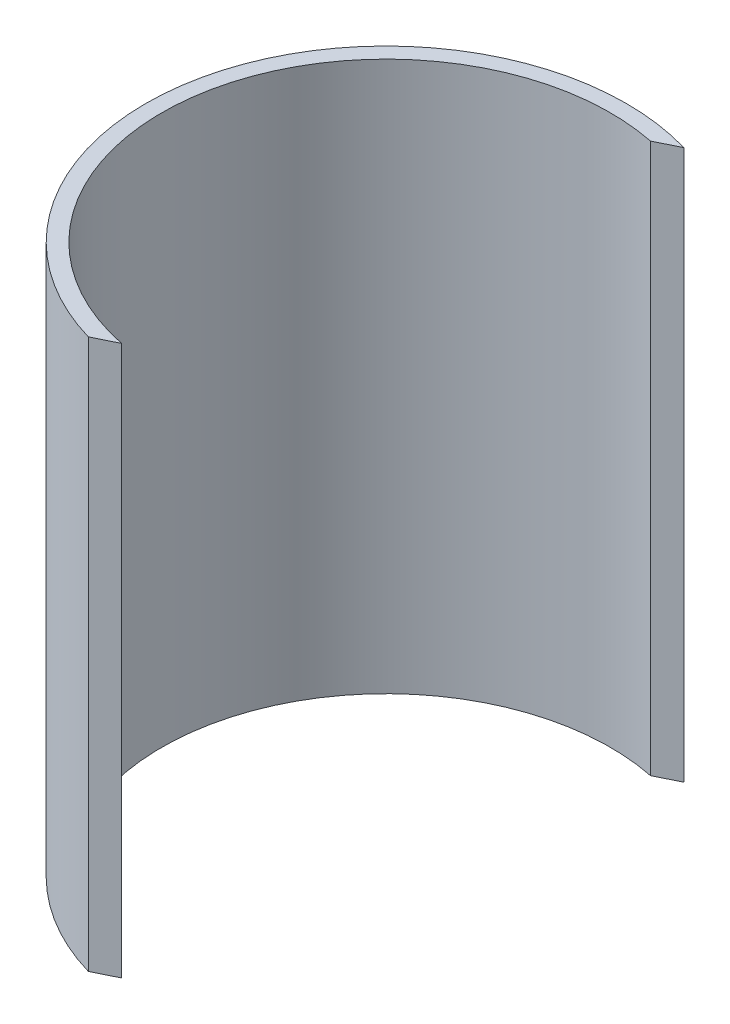
ISO-10303-21;
HEADER;
FILE_DESCRIPTION(('STEP AP214'),'2;1');
FILE_NAME('part.step','',(''),(''),'','','');
FILE_SCHEMA(('AUTOMOTIVE_DESIGN { 1 0 10303 214 1 1 1 1 }'));
ENDSEC;
DATA;
#1=APPLICATION_CONTEXT('core data for automotive mechanical design processes');
#2=APPLICATION_PROTOCOL_DEFINITION('international standard','automotive_design',2000,#1);
#3=PRODUCT_CONTEXT('',#1,'mechanical');
#4=PRODUCT('Part','Part','',(#3));
#5=PRODUCT_RELATED_PRODUCT_CATEGORY('part','',(#4));
#6=PRODUCT_DEFINITION_FORMATION('','',#4);
#7=PRODUCT_DEFINITION_CONTEXT('part definition',#1,'design');
#8=PRODUCT_DEFINITION('design','',#6,#7);
#9=PRODUCT_DEFINITION_SHAPE('','',#8);
#10=(LENGTH_UNIT() NAMED_UNIT(*) SI_UNIT(.MILLI.,.METRE.));
#11=(NAMED_UNIT(*) PLANE_ANGLE_UNIT() SI_UNIT($,.RADIAN.));
#12=(NAMED_UNIT(*) SI_UNIT($,.STERADIAN.) SOLID_ANGLE_UNIT());
#13=UNCERTAINTY_MEASURE_WITH_UNIT(LENGTH_MEASURE(1.E-05),#10,'distance_accuracy_value','');
#14=(GEOMETRIC_REPRESENTATION_CONTEXT(3) GLOBAL_UNCERTAINTY_ASSIGNED_CONTEXT((#13)) GLOBAL_UNIT_ASSIGNED_CONTEXT((#10,
#11,#12)) REPRESENTATION_CONTEXT('',''));
#15=CARTESIAN_POINT('',(0.,0.,0.));
#16=DIRECTION('',(0.,0.,1.));
#17=DIRECTION('',(1.,0.,0.));
#18=AXIS2_PLACEMENT_3D('',#15,#16,#17);
#19=CARTESIAN_POINT('',(0.,63.5,0.));
#20=DIRECTION('',(0.,-1.,0.));
#21=DIRECTION('',(0.,0.,-1.));
#22=AXIS2_PLACEMENT_3D('',#19,#20,#21);
#23=CYLINDRICAL_SURFACE('',#22,25.9175904418455);
#24=CARTESIAN_POINT('',(0.,0.,0.));
#25=DIRECTION('',(0.,-1.,0.));
#26=DIRECTION('',(0.,0.,-1.));
#27=AXIS2_PLACEMENT_3D('',#24,#25,#26);
#28=CIRCLE('',#27,25.9175904418455);
#29=CARTESIAN_POINT('',(-5.15378446495782,0.,25.4));
#30=VERTEX_POINT('',#29);
#31=CARTESIAN_POINT('',(5.15378446495807,0.,-25.4));
#32=VERTEX_POINT('',#31);
#33=EDGE_CURVE('E96',#30,#32,#28,.T.);
#34=ORIENTED_EDGE('',*,*,#33,.T.);
#35=DIRECTION('',(0.,-1.,0.));
#36=VECTOR('',#35,1.);
#37=CARTESIAN_POINT('',(5.15378446495807,63.5,-25.4));
#38=LINE('',#37,#36);
#39=CARTESIAN_POINT('',(5.15378446495807,63.5,-25.4));
#40=VERTEX_POINT('',#39);
#41=EDGE_CURVE('E11',#40,#32,#38,.T.);
#42=ORIENTED_EDGE('',*,*,#41,.F.);
#43=CARTESIAN_POINT('',(0.,63.5,0.));
#44=DIRECTION('',(0.,-1.,0.));
#45=DIRECTION('',(0.,0.,-1.));
#46=AXIS2_PLACEMENT_3D('',#43,#44,#45);
#47=CIRCLE('',#46,25.9175904418455);
#48=CARTESIAN_POINT('',(-5.15378446495782,63.5,25.4));
#49=VERTEX_POINT('',#48);
#50=EDGE_CURVE('E84',#49,#40,#47,.T.);
#51=ORIENTED_EDGE('',*,*,#50,.F.);
#52=DIRECTION('',(0.,-1.,0.));
#53=VECTOR('',#52,1.);
#54=CARTESIAN_POINT('',(-5.15378446495782,63.5,25.4));
#55=LINE('',#54,#53);
#56=EDGE_CURVE('E92',#49,#30,#55,.T.);
#57=ORIENTED_EDGE('',*,*,#56,.T.);
#58=EDGE_LOOP('',(#34,#42,#51,#57));
#59=FACE_BOUND('',#58,.T.);
#60=ADVANCED_FACE('F33',(#59),#23,.F.);
#61=CARTESIAN_POINT('',(7.73215943450578,63.5,-26.67));
#62=DIRECTION('',(-0.44186497590182,0.,-0.897081569909495));
#63=DIRECTION('',(-0.897081569909495,0.,0.44186497590182));
#64=AXIS2_PLACEMENT_3D('',#61,#62,#63);
#65=PLANE('',#64);
#66=DIRECTION('',(0.897081569909495,0.,-0.44186497590182));
#67=VECTOR('',#66,1.);
#68=CARTESIAN_POINT('',(7.73215943450578,0.,-26.67));
#69=LINE('',#68,#67);
#70=CARTESIAN_POINT('',(7.73215943450577,0.,-26.67));
#71=VERTEX_POINT('',#70);
#72=EDGE_CURVE('E88',#32,#71,#69,.T.);
#73=ORIENTED_EDGE('',*,*,#72,.T.);
#74=DIRECTION('',(0.,-1.,0.));
#75=VECTOR('',#74,1.);
#76=CARTESIAN_POINT('',(7.73215943450577,63.5,-26.67));
#77=LINE('',#76,#75);
#78=CARTESIAN_POINT('',(7.73215943450577,63.5,-26.67));
#79=VERTEX_POINT('',#78);
#80=EDGE_CURVE('E41',#79,#71,#77,.T.);
#81=ORIENTED_EDGE('',*,*,#80,.F.);
#82=DIRECTION('',(0.897081569909495,0.,-0.44186497590182));
#83=VECTOR('',#82,1.);
#84=CARTESIAN_POINT('',(7.73215943450578,63.5,-26.67));
#85=LINE('',#84,#83);
#86=EDGE_CURVE('E79',#40,#79,#85,.T.);
#87=ORIENTED_EDGE('',*,*,#86,.F.);
#88=ORIENTED_EDGE('',*,*,#41,.T.);
#89=EDGE_LOOP('',(#73,#81,#87,#88));
#90=FACE_BOUND('',#89,.T.);
#91=ADVANCED_FACE('F87',(#90),#65,.F.);
#92=CARTESIAN_POINT('',(0.,63.5,0.));
#93=DIRECTION('',(0.,-1.,0.));
#94=DIRECTION('',(0.,0.,-1.));
#95=AXIS2_PLACEMENT_3D('',#92,#93,#94);
#96=CYLINDRICAL_SURFACE('',#95,27.7682406630419);
#97=CARTESIAN_POINT('',(0.,0.,0.));
#98=DIRECTION('',(0.,1.,0.));
#99=DIRECTION('',(0.,0.,-1.));
#100=AXIS2_PLACEMENT_3D('',#97,#98,#99);
#101=CIRCLE('',#100,27.7682406630419);
#102=CARTESIAN_POINT('',(-7.73215943450555,0.,26.67));
#103=VERTEX_POINT('',#102);
#104=EDGE_CURVE('E66',#71,#103,#101,.T.);
#105=ORIENTED_EDGE('',*,*,#104,.T.);
#106=DIRECTION('',(0.,-1.,0.));
#107=VECTOR('',#106,1.);
#108=CARTESIAN_POINT('',(-7.73215943450555,63.5,26.67));
#109=LINE('',#108,#107);
#110=CARTESIAN_POINT('',(-7.73215943450555,63.5,26.67));
#111=VERTEX_POINT('',#110);
#112=EDGE_CURVE('E89',#111,#103,#109,.T.);
#113=ORIENTED_EDGE('',*,*,#112,.F.);
#114=CARTESIAN_POINT('',(0.,63.5,0.));
#115=DIRECTION('',(0.,1.,0.));
#116=DIRECTION('',(0.,0.,-1.));
#117=AXIS2_PLACEMENT_3D('',#114,#115,#116);
#118=CIRCLE('',#117,27.7682406630419);
#119=EDGE_CURVE('E82',#79,#111,#118,.T.);
#120=ORIENTED_EDGE('',*,*,#119,.F.);
#121=ORIENTED_EDGE('',*,*,#80,.T.);
#122=EDGE_LOOP('',(#105,#113,#120,#121));
#123=FACE_BOUND('',#122,.T.);
#124=ADVANCED_FACE('F90',(#123),#96,.T.);
#125=CARTESIAN_POINT('',(-7.73215943450555,63.5,26.67));
#126=DIRECTION('',(-0.441864975901821,0.,-0.897081569909495));
#127=DIRECTION('',(-0.897081569909495,0.,0.441864975901821));
#128=AXIS2_PLACEMENT_3D('',#125,#126,#127);
#129=PLANE('',#128);
#130=DIRECTION('',(0.897081569909495,0.,-0.441864975901821));
#131=VECTOR('',#130,1.);
#132=CARTESIAN_POINT('',(-7.73215943450555,0.,26.67));
#133=LINE('',#132,#131);
#134=EDGE_CURVE('E72',#103,#30,#133,.T.);
#135=ORIENTED_EDGE('',*,*,#134,.T.);
#136=ORIENTED_EDGE('',*,*,#56,.F.);
#137=DIRECTION('',(0.897081569909495,0.,-0.441864975901821));
#138=VECTOR('',#137,1.);
#139=CARTESIAN_POINT('',(-7.73215943450555,63.5,26.67));
#140=LINE('',#139,#138);
#141=EDGE_CURVE('E49',#111,#49,#140,.T.);
#142=ORIENTED_EDGE('',*,*,#141,.F.);
#143=ORIENTED_EDGE('',*,*,#112,.T.);
#144=EDGE_LOOP('',(#135,#136,#142,#143));
#145=FACE_BOUND('',#144,.T.);
#146=ADVANCED_FACE('F103',(#145),#129,.F.);
#147=CARTESIAN_POINT('',(0.,63.5,0.));
#148=DIRECTION('',(0.,-1.,0.));
#149=DIRECTION('',(0.,0.,-1.));
#150=AXIS2_PLACEMENT_3D('',#147,#148,#149);
#151=PLANE('',#150);
#152=ORIENTED_EDGE('',*,*,#50,.T.);
#153=ORIENTED_EDGE('',*,*,#86,.T.);
#154=ORIENTED_EDGE('',*,*,#119,.T.);
#155=ORIENTED_EDGE('',*,*,#141,.T.);
#156=EDGE_LOOP('',(#152,#153,#154,#155));
#157=FACE_BOUND('',#156,.T.);
#158=ADVANCED_FACE('F80',(#157),#151,.F.);
#159=CARTESIAN_POINT('',(0.,0.,0.));
#160=DIRECTION('',(0.,-1.,0.));
#161=DIRECTION('',(0.,0.,-1.));
#162=AXIS2_PLACEMENT_3D('',#159,#160,#161);
#163=PLANE('',#162);
#164=ORIENTED_EDGE('',*,*,#33,.F.);
#165=ORIENTED_EDGE('',*,*,#134,.F.);
#166=ORIENTED_EDGE('',*,*,#104,.F.);
#167=ORIENTED_EDGE('',*,*,#72,.F.);
#168=EDGE_LOOP('',(#164,#165,#166,#167));
#169=FACE_BOUND('',#168,.T.);
#170=ADVANCED_FACE('F106',(#169),#163,.T.);
#171=CLOSED_SHELL('',(#60,#91,#124,#146,#158,#170));
#172=MANIFOLD_SOLID_BREP('B2',#171);
#173=ADVANCED_BREP_SHAPE_REPRESENTATION('',(#18,#172),#14);
#174=SHAPE_DEFINITION_REPRESENTATION(#9,#173);
ENDSEC;
END-ISO-10303-21;
